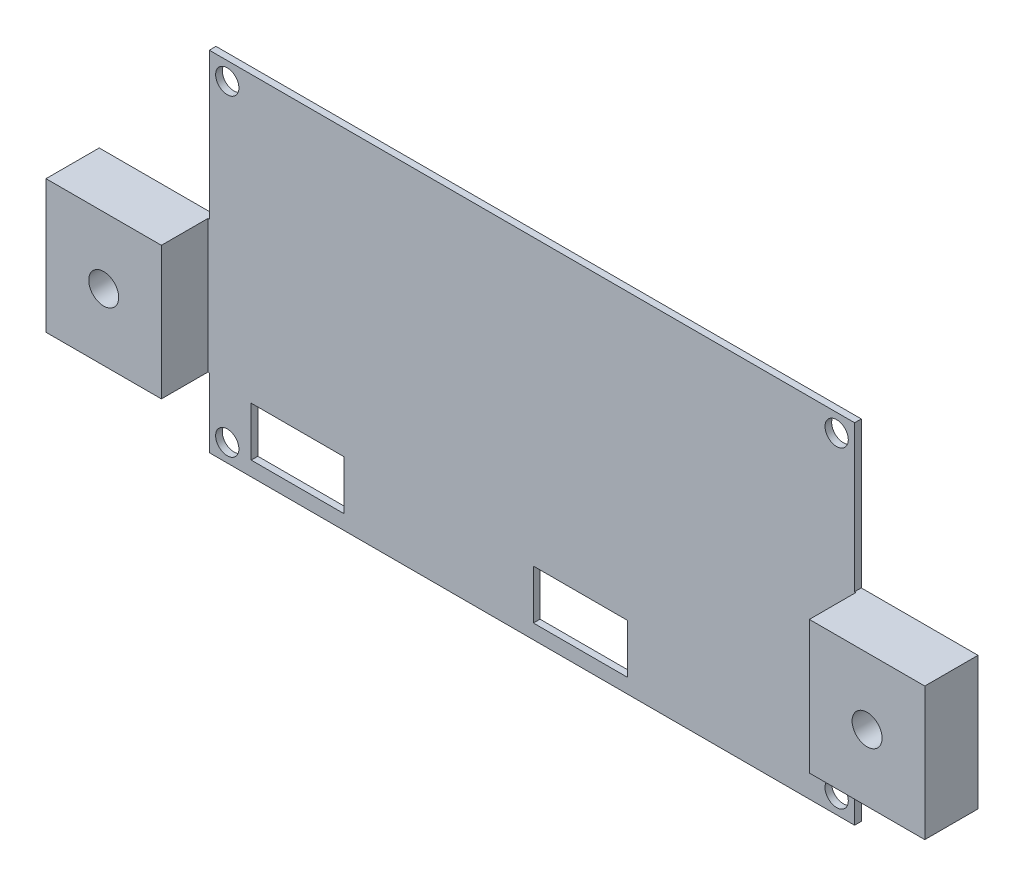
ISO-10303-21;
HEADER;
FILE_DESCRIPTION(('STEP AP214'),'2;1');
FILE_NAME('part.step','',(''),(''),'','','');
FILE_SCHEMA(('AUTOMOTIVE_DESIGN { 1 0 10303 214 1 1 1 1 }'));
ENDSEC;
DATA;
#1=APPLICATION_CONTEXT('core data for automotive mechanical design processes');
#2=APPLICATION_PROTOCOL_DEFINITION('international standard','automotive_design',2000,#1);
#3=PRODUCT_CONTEXT('',#1,'mechanical');
#4=PRODUCT('Part','Part','',(#3));
#5=PRODUCT_RELATED_PRODUCT_CATEGORY('part','',(#4));
#6=PRODUCT_DEFINITION_FORMATION('','',#4);
#7=PRODUCT_DEFINITION_CONTEXT('part definition',#1,'design');
#8=PRODUCT_DEFINITION('design','',#6,#7);
#9=PRODUCT_DEFINITION_SHAPE('','',#8);
#10=(LENGTH_UNIT() NAMED_UNIT(*) SI_UNIT(.MILLI.,.METRE.));
#11=(NAMED_UNIT(*) PLANE_ANGLE_UNIT() SI_UNIT($,.RADIAN.));
#12=(NAMED_UNIT(*) SI_UNIT($,.STERADIAN.) SOLID_ANGLE_UNIT());
#13=UNCERTAINTY_MEASURE_WITH_UNIT(LENGTH_MEASURE(1.E-05),#10,'distance_accuracy_value','');
#14=(GEOMETRIC_REPRESENTATION_CONTEXT(3) GLOBAL_UNCERTAINTY_ASSIGNED_CONTEXT((#13)) GLOBAL_UNIT_ASSIGNED_CONTEXT((#10,
#11,#12)) REPRESENTATION_CONTEXT('',''));
#15=CARTESIAN_POINT('',(0.,0.,0.));
#16=DIRECTION('',(0.,0.,1.));
#17=DIRECTION('',(1.,0.,0.));
#18=AXIS2_PLACEMENT_3D('',#15,#16,#17);
#19=CARTESIAN_POINT('',(0.,0.,1.));
#20=DIRECTION('',(0.,0.,-1.));
#21=DIRECTION('',(-1.,0.,0.));
#22=AXIS2_PLACEMENT_3D('',#19,#20,#21);
#23=PLANE('',#22);
#24=DIRECTION('',(0.,1.,0.));
#25=VECTOR('',#24,1.);
#26=CARTESIAN_POINT('',(62.8755550121784,2.18592698705528,1.));
#27=LINE('',#26,#25);
#28=CARTESIAN_POINT('',(62.8755550121784,2.18592698705528,1.));
#29=VERTEX_POINT('',#28);
#30=CARTESIAN_POINT('',(62.8755550121784,9.59959441499132,1.));
#31=VERTEX_POINT('',#30);
#32=EDGE_CURVE('E248',#29,#31,#27,.T.);
#33=ORIENTED_EDGE('',*,*,#32,.F.);
#34=DIRECTION('',(1.,0.,0.));
#35=VECTOR('',#34,1.);
#36=CARTESIAN_POINT('',(62.8755550121784,2.18592698705528,1.));
#37=LINE('',#36,#35);
#38=CARTESIAN_POINT('',(48.716607668951,2.18592698705528,1.));
#39=VERTEX_POINT('',#38);
#40=EDGE_CURVE('E256',#39,#29,#37,.T.);
#41=ORIENTED_EDGE('',*,*,#40,.F.);
#42=DIRECTION('',(0.,-1.,0.));
#43=VECTOR('',#42,1.);
#44=CARTESIAN_POINT('',(48.716607668951,2.18592698705528,1.));
#45=LINE('',#44,#43);
#46=CARTESIAN_POINT('',(48.716607668951,9.59959441499132,1.));
#47=VERTEX_POINT('',#46);
#48=EDGE_CURVE('E253',#47,#39,#45,.T.);
#49=ORIENTED_EDGE('',*,*,#48,.F.);
#50=DIRECTION('',(-1.,0.,0.));
#51=VECTOR('',#50,1.);
#52=CARTESIAN_POINT('',(62.8755550121784,9.59959441499132,1.));
#53=LINE('',#52,#51);
#54=EDGE_CURVE('E250',#31,#47,#53,.T.);
#55=ORIENTED_EDGE('',*,*,#54,.F.);
#56=EDGE_LOOP('',(#33,#41,#49,#55));
#57=FACE_BOUND('',#56,.T.);
#58=CARTESIAN_POINT('',(2.69999999999999,49.7,1.));
#59=DIRECTION('',(0.,0.,1.));
#60=DIRECTION('',(1.,0.,0.));
#61=AXIS2_PLACEMENT_3D('',#58,#59,#60);
#62=CIRCLE('',#61,1.75);
#63=CARTESIAN_POINT('',(4.45,49.7,1.));
#64=VERTEX_POINT('',#63);
#65=EDGE_CURVE('E310',#64,#64,#62,.T.);
#66=ORIENTED_EDGE('',*,*,#65,.F.);
#67=EDGE_LOOP('',(#66));
#68=FACE_BOUND('',#67,.T.);
#69=CARTESIAN_POINT('',(2.7,2.7,1.));
#70=DIRECTION('',(0.,0.,1.));
#71=DIRECTION('',(1.,0.,0.));
#72=AXIS2_PLACEMENT_3D('',#69,#70,#71);
#73=CIRCLE('',#72,1.75);
#74=CARTESIAN_POINT('',(4.45,2.7,1.));
#75=VERTEX_POINT('',#74);
#76=EDGE_CURVE('E316',#75,#75,#73,.T.);
#77=ORIENTED_EDGE('',*,*,#76,.F.);
#78=EDGE_LOOP('',(#77));
#79=FACE_BOUND('',#78,.T.);
#80=CARTESIAN_POINT('',(94.3,2.70000000000001,1.));
#81=DIRECTION('',(0.,0.,1.));
#82=DIRECTION('',(1.,0.,0.));
#83=AXIS2_PLACEMENT_3D('',#80,#81,#82);
#84=CIRCLE('',#83,1.75);
#85=CARTESIAN_POINT('',(96.05,2.70000000000001,1.));
#86=VERTEX_POINT('',#85);
#87=EDGE_CURVE('E322',#86,#86,#84,.T.);
#88=ORIENTED_EDGE('',*,*,#87,.F.);
#89=EDGE_LOOP('',(#88));
#90=FACE_BOUND('',#89,.T.);
#91=CARTESIAN_POINT('',(94.3,49.7,1.));
#92=DIRECTION('',(0.,0.,1.));
#93=DIRECTION('',(1.,0.,0.));
#94=AXIS2_PLACEMENT_3D('',#91,#92,#93);
#95=CIRCLE('',#94,1.75);
#96=CARTESIAN_POINT('',(96.05,49.7,1.));
#97=VERTEX_POINT('',#96);
#98=EDGE_CURVE('E328',#97,#97,#95,.T.);
#99=ORIENTED_EDGE('',*,*,#98,.F.);
#100=EDGE_LOOP('',(#99));
#101=FACE_BOUND('',#100,.T.);
#102=DIRECTION('',(0.,-1.,0.));
#103=VECTOR('',#102,1.);
#104=CARTESIAN_POINT('',(6.29845885437089,2.18592698705528,1.));
#105=LINE('',#104,#103);
#106=CARTESIAN_POINT('',(6.29845885437089,9.59959441499131,1.));
#107=VERTEX_POINT('',#106);
#108=CARTESIAN_POINT('',(6.29845885437089,2.18592698705528,1.));
#109=VERTEX_POINT('',#108);
#110=EDGE_CURVE('E279',#107,#109,#105,.T.);
#111=ORIENTED_EDGE('',*,*,#110,.F.);
#112=DIRECTION('',(-1.,0.,0.));
#113=VECTOR('',#112,1.);
#114=CARTESIAN_POINT('',(6.29845885437089,9.59959441499131,1.));
#115=LINE('',#114,#113);
#116=CARTESIAN_POINT('',(20.2146229173687,9.59959441499131,1.));
#117=VERTEX_POINT('',#116);
#118=EDGE_CURVE('E287',#117,#107,#115,.T.);
#119=ORIENTED_EDGE('',*,*,#118,.F.);
#120=DIRECTION('',(0.,1.,0.));
#121=VECTOR('',#120,1.);
#122=CARTESIAN_POINT('',(20.2146229173687,2.18592698705528,1.));
#123=LINE('',#122,#121);
#124=CARTESIAN_POINT('',(20.2146229173687,2.18592698705528,1.));
#125=VERTEX_POINT('',#124);
#126=EDGE_CURVE('E284',#125,#117,#123,.T.);
#127=ORIENTED_EDGE('',*,*,#126,.F.);
#128=DIRECTION('',(1.,0.,0.));
#129=VECTOR('',#128,1.);
#130=CARTESIAN_POINT('',(6.29845885437089,2.18592698705528,1.));
#131=LINE('',#130,#129);
#132=EDGE_CURVE('E281',#109,#125,#131,.T.);
#133=ORIENTED_EDGE('',*,*,#132,.F.);
#134=EDGE_LOOP('',(#111,#119,#127,#133));
#135=FACE_BOUND('',#134,.T.);
#136=DIRECTION('',(1.,0.,0.));
#137=VECTOR('',#136,1.);
#138=CARTESIAN_POINT('',(114.547708730617,10.4,1.));
#139=LINE('',#138,#137);
#140=CARTESIAN_POINT('',(97.,10.4,1.));
#141=VERTEX_POINT('',#140);
#142=CARTESIAN_POINT('',(97.2,10.4,1.));
#143=VERTEX_POINT('',#142);
#144=EDGE_CURVE('E49',#141,#143,#139,.T.);
#145=ORIENTED_EDGE('',*,*,#144,.T.);
#146=DIRECTION('',(0.,1.,0.));
#147=VECTOR('',#146,1.);
#148=CARTESIAN_POINT('',(97.2,0.,1.));
#149=LINE('',#148,#147);
#150=CARTESIAN_POINT('',(97.2,30.4,1.));
#151=VERTEX_POINT('',#150);
#152=EDGE_CURVE('E201',#143,#151,#149,.T.);
#153=ORIENTED_EDGE('',*,*,#152,.T.);
#154=DIRECTION('',(-1.,0.,0.));
#155=VECTOR('',#154,1.);
#156=CARTESIAN_POINT('',(97.,30.4,1.));
#157=LINE('',#156,#155);
#158=CARTESIAN_POINT('',(97.,30.4,1.));
#159=VERTEX_POINT('',#158);
#160=EDGE_CURVE('E343',#151,#159,#157,.T.);
#161=ORIENTED_EDGE('',*,*,#160,.T.);
#162=DIRECTION('',(0.,1.,0.));
#163=VECTOR('',#162,1.);
#164=CARTESIAN_POINT('',(97.,30.4,1.));
#165=LINE('',#164,#163);
#166=CARTESIAN_POINT('',(97.,52.4,1.));
#167=VERTEX_POINT('',#166);
#168=EDGE_CURVE('E345',#159,#167,#165,.T.);
#169=ORIENTED_EDGE('',*,*,#168,.T.);
#170=DIRECTION('',(-1.,0.,0.));
#171=VECTOR('',#170,1.);
#172=CARTESIAN_POINT('',(0.,52.4,1.));
#173=LINE('',#172,#171);
#174=CARTESIAN_POINT('',(0.,52.4,1.));
#175=VERTEX_POINT('',#174);
#176=EDGE_CURVE('E347',#167,#175,#173,.T.);
#177=ORIENTED_EDGE('',*,*,#176,.T.);
#178=DIRECTION('',(0.,-1.,0.));
#179=VECTOR('',#178,1.);
#180=CARTESIAN_POINT('',(0.,30.4,1.));
#181=LINE('',#180,#179);
#182=CARTESIAN_POINT('',(0.,30.4,1.));
#183=VERTEX_POINT('',#182);
#184=EDGE_CURVE('E349',#175,#183,#181,.T.);
#185=ORIENTED_EDGE('',*,*,#184,.T.);
#186=DIRECTION('',(-1.,0.,0.));
#187=VECTOR('',#186,1.);
#188=CARTESIAN_POINT('',(0.,30.4,1.));
#189=LINE('',#188,#187);
#190=CARTESIAN_POINT('',(-0.200000000000008,30.4,1.));
#191=VERTEX_POINT('',#190);
#192=EDGE_CURVE('E351',#183,#191,#189,.T.);
#193=ORIENTED_EDGE('',*,*,#192,.T.);
#194=DIRECTION('',(0.,1.,0.));
#195=VECTOR('',#194,1.);
#196=CARTESIAN_POINT('',(-0.200000000000008,0.,1.));
#197=LINE('',#196,#195);
#198=CARTESIAN_POINT('',(-0.200000000000009,10.4,1.));
#199=VERTEX_POINT('',#198);
#200=EDGE_CURVE('E56',#199,#191,#197,.T.);
#201=ORIENTED_EDGE('',*,*,#200,.F.);
#202=DIRECTION('',(1.,0.,0.));
#203=VECTOR('',#202,1.);
#204=CARTESIAN_POINT('',(-17.5477087306169,10.4,1.));
#205=LINE('',#204,#203);
#206=CARTESIAN_POINT('',(0.,10.4,1.));
#207=VERTEX_POINT('',#206);
#208=EDGE_CURVE('E353',#199,#207,#205,.T.);
#209=ORIENTED_EDGE('',*,*,#208,.T.);
#210=DIRECTION('',(0.,-1.,0.));
#211=VECTOR('',#210,1.);
#212=CARTESIAN_POINT('',(0.,0.,1.));
#213=LINE('',#212,#211);
#214=CARTESIAN_POINT('',(0.,0.,1.));
#215=VERTEX_POINT('',#214);
#216=EDGE_CURVE('E334',#207,#215,#213,.T.);
#217=ORIENTED_EDGE('',*,*,#216,.T.);
#218=DIRECTION('',(1.,0.,0.));
#219=VECTOR('',#218,1.);
#220=CARTESIAN_POINT('',(0.,0.,1.));
#221=LINE('',#220,#219);
#222=CARTESIAN_POINT('',(97.,0.,1.));
#223=VERTEX_POINT('',#222);
#224=EDGE_CURVE('E337',#215,#223,#221,.T.);
#225=ORIENTED_EDGE('',*,*,#224,.T.);
#226=DIRECTION('',(0.,1.,0.));
#227=VECTOR('',#226,1.);
#228=CARTESIAN_POINT('',(97.,0.,1.));
#229=LINE('',#228,#227);
#230=EDGE_CURVE('E340',#223,#141,#229,.T.);
#231=ORIENTED_EDGE('',*,*,#230,.T.);
#232=EDGE_LOOP('',(#145,#153,#161,#169,#177,#185,#193,#201,#209,#217,#225,#231));
#233=FACE_BOUND('',#232,.T.);
#234=ADVANCED_FACE('F34',(#57,#68,#79,#90,#101,#135,#233),#23,.F.);
#235=CARTESIAN_POINT('',(0.,0.,0.));
#236=DIRECTION('',(0.,0.,-1.));
#237=DIRECTION('',(-1.,0.,0.));
#238=AXIS2_PLACEMENT_3D('',#235,#236,#237);
#239=PLANE('',#238);
#240=CARTESIAN_POINT('',(-8.87385436530845,20.4,0.));
#241=DIRECTION('',(0.,0.,1.));
#242=DIRECTION('',(1.,0.,0.));
#243=AXIS2_PLACEMENT_3D('',#240,#241,#242);
#244=CIRCLE('',#243,2.25);
#245=CARTESIAN_POINT('',(-6.62385436530845,20.4,0.));
#246=VERTEX_POINT('',#245);
#247=EDGE_CURVE('E220',#246,#246,#244,.T.);
#248=ORIENTED_EDGE('',*,*,#247,.T.);
#249=EDGE_LOOP('',(#248));
#250=FACE_BOUND('',#249,.T.);
#251=CARTESIAN_POINT('',(105.873854365308,20.4,0.));
#252=DIRECTION('',(0.,0.,1.));
#253=DIRECTION('',(-1.,0.,0.));
#254=AXIS2_PLACEMENT_3D('',#251,#252,#253);
#255=CIRCLE('',#254,2.25);
#256=CARTESIAN_POINT('',(103.623854365308,20.4,0.));
#257=VERTEX_POINT('',#256);
#258=EDGE_CURVE('E698',#257,#257,#255,.T.);
#259=ORIENTED_EDGE('',*,*,#258,.T.);
#260=EDGE_LOOP('',(#259));
#261=FACE_BOUND('',#260,.T.);
#262=CARTESIAN_POINT('',(2.7,2.7,0.));
#263=DIRECTION('',(0.,0.,1.));
#264=DIRECTION('',(1.,0.,0.));
#265=AXIS2_PLACEMENT_3D('',#262,#263,#264);
#266=CIRCLE('',#265,1.75);
#267=CARTESIAN_POINT('',(4.45,2.7,0.));
#268=VERTEX_POINT('',#267);
#269=EDGE_CURVE('E313',#268,#268,#266,.T.);
#270=ORIENTED_EDGE('',*,*,#269,.T.);
#271=EDGE_LOOP('',(#270));
#272=FACE_BOUND('',#271,.T.);
#273=CARTESIAN_POINT('',(94.3,49.7,0.));
#274=DIRECTION('',(0.,0.,1.));
#275=DIRECTION('',(1.,0.,0.));
#276=AXIS2_PLACEMENT_3D('',#273,#274,#275);
#277=CIRCLE('',#276,1.75);
#278=CARTESIAN_POINT('',(96.05,49.7,0.));
#279=VERTEX_POINT('',#278);
#280=EDGE_CURVE('E325',#279,#279,#277,.T.);
#281=ORIENTED_EDGE('',*,*,#280,.T.);
#282=EDGE_LOOP('',(#281));
#283=FACE_BOUND('',#282,.T.);
#284=DIRECTION('',(0.,-1.,0.));
#285=VECTOR('',#284,1.);
#286=CARTESIAN_POINT('',(0.,0.,0.));
#287=LINE('',#286,#285);
#288=CARTESIAN_POINT('',(0.,10.4,0.));
#289=VERTEX_POINT('',#288);
#290=CARTESIAN_POINT('',(0.,0.,0.));
#291=VERTEX_POINT('',#290);
#292=EDGE_CURVE('E331',#289,#291,#287,.T.);
#293=ORIENTED_EDGE('',*,*,#292,.F.);
#294=DIRECTION('',(1.,0.,0.));
#295=VECTOR('',#294,1.);
#296=CARTESIAN_POINT('',(-17.5477087306169,10.4,0.));
#297=LINE('',#296,#295);
#298=CARTESIAN_POINT('',(-17.5477087306169,10.4,0.));
#299=VERTEX_POINT('',#298);
#300=EDGE_CURVE('E338',#299,#289,#297,.T.);
#301=ORIENTED_EDGE('',*,*,#300,.F.);
#302=DIRECTION('',(0.,-1.,0.));
#303=VECTOR('',#302,1.);
#304=CARTESIAN_POINT('',(-17.5477087306169,30.4,0.));
#305=LINE('',#304,#303);
#306=CARTESIAN_POINT('',(-17.5477087306169,30.4,0.));
#307=VERTEX_POINT('',#306);
#308=EDGE_CURVE('E376',#307,#299,#305,.T.);
#309=ORIENTED_EDGE('',*,*,#308,.F.);
#310=DIRECTION('',(-1.,0.,0.));
#311=VECTOR('',#310,1.);
#312=CARTESIAN_POINT('',(0.,30.4,0.));
#313=LINE('',#312,#311);
#314=CARTESIAN_POINT('',(0.,30.4,0.));
#315=VERTEX_POINT('',#314);
#316=EDGE_CURVE('E374',#315,#307,#313,.T.);
#317=ORIENTED_EDGE('',*,*,#316,.F.);
#318=DIRECTION('',(0.,-1.,0.));
#319=VECTOR('',#318,1.);
#320=CARTESIAN_POINT('',(0.,30.4,0.));
#321=LINE('',#320,#319);
#322=CARTESIAN_POINT('',(0.,52.4,0.));
#323=VERTEX_POINT('',#322);
#324=EDGE_CURVE('E372',#323,#315,#321,.T.);
#325=ORIENTED_EDGE('',*,*,#324,.F.);
#326=DIRECTION('',(-1.,0.,0.));
#327=VECTOR('',#326,1.);
#328=CARTESIAN_POINT('',(0.,52.4,0.));
#329=LINE('',#328,#327);
#330=CARTESIAN_POINT('',(97.,52.4,0.));
#331=VERTEX_POINT('',#330);
#332=EDGE_CURVE('E370',#331,#323,#329,.T.);
#333=ORIENTED_EDGE('',*,*,#332,.F.);
#334=DIRECTION('',(0.,1.,0.));
#335=VECTOR('',#334,1.);
#336=CARTESIAN_POINT('',(97.,30.4,0.));
#337=LINE('',#336,#335);
#338=CARTESIAN_POINT('',(97.,30.4,0.));
#339=VERTEX_POINT('',#338);
#340=EDGE_CURVE('E368',#339,#331,#337,.T.);
#341=ORIENTED_EDGE('',*,*,#340,.F.);
#342=DIRECTION('',(-1.,0.,0.));
#343=VECTOR('',#342,1.);
#344=CARTESIAN_POINT('',(97.,30.4,0.));
#345=LINE('',#344,#343);
#346=CARTESIAN_POINT('',(114.547708730617,30.4,0.));
#347=VERTEX_POINT('',#346);
#348=EDGE_CURVE('E366',#347,#339,#345,.T.);
#349=ORIENTED_EDGE('',*,*,#348,.F.);
#350=DIRECTION('',(0.,1.,0.));
#351=VECTOR('',#350,1.);
#352=CARTESIAN_POINT('',(114.547708730617,30.4,0.));
#353=LINE('',#352,#351);
#354=CARTESIAN_POINT('',(114.547708730617,10.4,0.));
#355=VERTEX_POINT('',#354);
#356=EDGE_CURVE('E364',#355,#347,#353,.T.);
#357=ORIENTED_EDGE('',*,*,#356,.F.);
#358=DIRECTION('',(1.,0.,0.));
#359=VECTOR('',#358,1.);
#360=CARTESIAN_POINT('',(114.547708730617,10.4,0.));
#361=LINE('',#360,#359);
#362=CARTESIAN_POINT('',(97.,10.4,0.));
#363=VERTEX_POINT('',#362);
#364=EDGE_CURVE('E362',#363,#355,#361,.T.);
#365=ORIENTED_EDGE('',*,*,#364,.F.);
#366=DIRECTION('',(0.,1.,0.));
#367=VECTOR('',#366,1.);
#368=CARTESIAN_POINT('',(97.,0.,0.));
#369=LINE('',#368,#367);
#370=CARTESIAN_POINT('',(97.,0.,0.));
#371=VERTEX_POINT('',#370);
#372=EDGE_CURVE('E360',#371,#363,#369,.T.);
#373=ORIENTED_EDGE('',*,*,#372,.F.);
#374=DIRECTION('',(1.,0.,0.));
#375=VECTOR('',#374,1.);
#376=CARTESIAN_POINT('',(0.,0.,0.));
#377=LINE('',#376,#375);
#378=EDGE_CURVE('E358',#291,#371,#377,.T.);
#379=ORIENTED_EDGE('',*,*,#378,.F.);
#380=EDGE_LOOP('',(#293,#301,#309,#317,#325,#333,#341,#349,#357,#365,#373,#379));
#381=FACE_BOUND('',#380,.T.);
#382=CARTESIAN_POINT('',(94.3,2.70000000000001,0.));
#383=DIRECTION('',(0.,0.,1.));
#384=DIRECTION('',(1.,0.,0.));
#385=AXIS2_PLACEMENT_3D('',#382,#383,#384);
#386=CIRCLE('',#385,1.75);
#387=CARTESIAN_POINT('',(96.05,2.70000000000001,0.));
#388=VERTEX_POINT('',#387);
#389=EDGE_CURVE('E319',#388,#388,#386,.T.);
#390=ORIENTED_EDGE('',*,*,#389,.T.);
#391=EDGE_LOOP('',(#390));
#392=FACE_BOUND('',#391,.T.);
#393=CARTESIAN_POINT('',(2.69999999999999,49.7,0.));
#394=DIRECTION('',(0.,0.,1.));
#395=DIRECTION('',(1.,0.,0.));
#396=AXIS2_PLACEMENT_3D('',#393,#394,#395);
#397=CIRCLE('',#396,1.75);
#398=CARTESIAN_POINT('',(4.45,49.7,0.));
#399=VERTEX_POINT('',#398);
#400=EDGE_CURVE('E309',#399,#399,#397,.T.);
#401=ORIENTED_EDGE('',*,*,#400,.T.);
#402=EDGE_LOOP('',(#401));
#403=FACE_BOUND('',#402,.T.);
#404=DIRECTION('',(-1.,0.,0.));
#405=VECTOR('',#404,1.);
#406=CARTESIAN_POINT('',(6.29845885437089,9.59959441499131,0.));
#407=LINE('',#406,#405);
#408=CARTESIAN_POINT('',(20.2146229173687,9.59959441499131,0.));
#409=VERTEX_POINT('',#408);
#410=CARTESIAN_POINT('',(6.29845885437089,9.59959441499131,0.));
#411=VERTEX_POINT('',#410);
#412=EDGE_CURVE('E282',#409,#411,#407,.T.);
#413=ORIENTED_EDGE('',*,*,#412,.T.);
#414=DIRECTION('',(0.,-1.,0.));
#415=VECTOR('',#414,1.);
#416=CARTESIAN_POINT('',(6.29845885437089,2.18592698705528,0.));
#417=LINE('',#416,#415);
#418=CARTESIAN_POINT('',(6.29845885437089,2.18592698705528,0.));
#419=VERTEX_POINT('',#418);
#420=EDGE_CURVE('E278',#411,#419,#417,.T.);
#421=ORIENTED_EDGE('',*,*,#420,.T.);
#422=DIRECTION('',(1.,0.,0.));
#423=VECTOR('',#422,1.);
#424=CARTESIAN_POINT('',(6.29845885437089,2.18592698705528,0.));
#425=LINE('',#424,#423);
#426=CARTESIAN_POINT('',(20.2146229173687,2.18592698705528,0.));
#427=VERTEX_POINT('',#426);
#428=EDGE_CURVE('E292',#419,#427,#425,.T.);
#429=ORIENTED_EDGE('',*,*,#428,.T.);
#430=DIRECTION('',(0.,1.,0.));
#431=VECTOR('',#430,1.);
#432=CARTESIAN_POINT('',(20.2146229173687,2.18592698705528,0.));
#433=LINE('',#432,#431);
#434=EDGE_CURVE('E295',#427,#409,#433,.T.);
#435=ORIENTED_EDGE('',*,*,#434,.T.);
#436=EDGE_LOOP('',(#413,#421,#429,#435));
#437=FACE_BOUND('',#436,.T.);
#438=DIRECTION('',(1.,0.,0.));
#439=VECTOR('',#438,1.);
#440=CARTESIAN_POINT('',(62.8755550121784,2.18592698705528,0.));
#441=LINE('',#440,#439);
#442=CARTESIAN_POINT('',(48.716607668951,2.18592698705528,0.));
#443=VERTEX_POINT('',#442);
#444=CARTESIAN_POINT('',(62.8755550121784,2.18592698705528,0.));
#445=VERTEX_POINT('',#444);
#446=EDGE_CURVE('E251',#443,#445,#441,.T.);
#447=ORIENTED_EDGE('',*,*,#446,.T.);
#448=DIRECTION('',(0.,1.,0.));
#449=VECTOR('',#448,1.);
#450=CARTESIAN_POINT('',(62.8755550121784,2.18592698705528,0.));
#451=LINE('',#450,#449);
#452=CARTESIAN_POINT('',(62.8755550121784,9.59959441499132,0.));
#453=VERTEX_POINT('',#452);
#454=EDGE_CURVE('E247',#445,#453,#451,.T.);
#455=ORIENTED_EDGE('',*,*,#454,.T.);
#456=DIRECTION('',(-1.,0.,0.));
#457=VECTOR('',#456,1.);
#458=CARTESIAN_POINT('',(62.8755550121784,9.59959441499132,0.));
#459=LINE('',#458,#457);
#460=CARTESIAN_POINT('',(48.716607668951,9.59959441499132,0.));
#461=VERTEX_POINT('',#460);
#462=EDGE_CURVE('E261',#453,#461,#459,.T.);
#463=ORIENTED_EDGE('',*,*,#462,.T.);
#464=DIRECTION('',(0.,-1.,0.));
#465=VECTOR('',#464,1.);
#466=CARTESIAN_POINT('',(48.716607668951,2.18592698705528,0.));
#467=LINE('',#466,#465);
#468=EDGE_CURVE('E264',#461,#443,#467,.T.);
#469=ORIENTED_EDGE('',*,*,#468,.T.);
#470=EDGE_LOOP('',(#447,#455,#463,#469));
#471=FACE_BOUND('',#470,.T.);
#472=ADVANCED_FACE('F416',(#250,#261,#272,#283,#381,#392,#403,#437,#471),#239,.T.);
#473=CARTESIAN_POINT('',(0.,0.,1.));
#474=DIRECTION('',(1.,0.,0.));
#475=DIRECTION('',(0.,0.,-1.));
#476=AXIS2_PLACEMENT_3D('',#473,#474,#475);
#477=PLANE('',#476);
#478=ORIENTED_EDGE('',*,*,#292,.T.);
#479=DIRECTION('',(0.,0.,-1.));
#480=VECTOR('',#479,1.);
#481=CARTESIAN_POINT('',(0.,0.,1.));
#482=LINE('',#481,#480);
#483=EDGE_CURVE('E11',#215,#291,#482,.T.);
#484=ORIENTED_EDGE('',*,*,#483,.F.);
#485=ORIENTED_EDGE('',*,*,#216,.F.);
#486=DIRECTION('',(0.,0.,-1.));
#487=VECTOR('',#486,1.);
#488=CARTESIAN_POINT('',(0.,10.4,1.));
#489=LINE('',#488,#487);
#490=EDGE_CURVE('E355',#207,#289,#489,.T.);
#491=ORIENTED_EDGE('',*,*,#490,.T.);
#492=EDGE_LOOP('',(#478,#484,#485,#491));
#493=FACE_BOUND('',#492,.T.);
#494=ADVANCED_FACE('F36',(#493),#477,.F.);
#495=CARTESIAN_POINT('',(0.,0.,1.));
#496=DIRECTION('',(0.,1.,0.));
#497=DIRECTION('',(0.,0.,1.));
#498=AXIS2_PLACEMENT_3D('',#495,#496,#497);
#499=PLANE('',#498);
#500=ORIENTED_EDGE('',*,*,#378,.T.);
#501=DIRECTION('',(0.,0.,-1.));
#502=VECTOR('',#501,1.);
#503=CARTESIAN_POINT('',(97.,0.,1.));
#504=LINE('',#503,#502);
#505=EDGE_CURVE('E42',#223,#371,#504,.T.);
#506=ORIENTED_EDGE('',*,*,#505,.F.);
#507=ORIENTED_EDGE('',*,*,#224,.F.);
#508=ORIENTED_EDGE('',*,*,#483,.T.);
#509=EDGE_LOOP('',(#500,#506,#507,#508));
#510=FACE_BOUND('',#509,.T.);
#511=ADVANCED_FACE('F471',(#510),#499,.F.);
#512=CARTESIAN_POINT('',(97.,0.,1.));
#513=DIRECTION('',(-1.,0.,0.));
#514=DIRECTION('',(0.,-1.,0.));
#515=AXIS2_PLACEMENT_3D('',#512,#513,#514);
#516=PLANE('',#515);
#517=ORIENTED_EDGE('',*,*,#372,.T.);
#518=DIRECTION('',(0.,0.,-1.));
#519=VECTOR('',#518,1.);
#520=CARTESIAN_POINT('',(97.,10.4,1.));
#521=LINE('',#520,#519);
#522=EDGE_CURVE('E403',#141,#363,#521,.T.);
#523=ORIENTED_EDGE('',*,*,#522,.F.);
#524=ORIENTED_EDGE('',*,*,#230,.F.);
#525=ORIENTED_EDGE('',*,*,#505,.T.);
#526=EDGE_LOOP('',(#517,#523,#524,#525));
#527=FACE_BOUND('',#526,.T.);
#528=ADVANCED_FACE('F410',(#527),#516,.F.);
#529=CARTESIAN_POINT('',(114.547708730617,10.4,1.));
#530=DIRECTION('',(0.,1.,0.));
#531=DIRECTION('',(-1.,0.,0.));
#532=AXIS2_PLACEMENT_3D('',#529,#530,#531);
#533=PLANE('',#532);
#534=ORIENTED_EDGE('',*,*,#364,.T.);
#535=DIRECTION('',(0.,0.,-1.));
#536=VECTOR('',#535,1.);
#537=CARTESIAN_POINT('',(114.547708730617,10.4,1.));
#538=LINE('',#537,#536);
#539=CARTESIAN_POINT('',(114.547708730617,10.4,8.));
#540=VERTEX_POINT('',#539);
#541=EDGE_CURVE('E209',#540,#355,#538,.T.);
#542=ORIENTED_EDGE('',*,*,#541,.F.);
#543=DIRECTION('',(1.,0.,0.));
#544=VECTOR('',#543,1.);
#545=CARTESIAN_POINT('',(0.,10.4,8.));
#546=LINE('',#545,#544);
#547=CARTESIAN_POINT('',(97.2,10.4,8.));
#548=VERTEX_POINT('',#547);
#549=EDGE_CURVE('E206',#548,#540,#546,.T.);
#550=ORIENTED_EDGE('',*,*,#549,.F.);
#551=DIRECTION('',(0.,0.,-1.));
#552=VECTOR('',#551,1.);
#553=CARTESIAN_POINT('',(97.2,10.4,8.));
#554=LINE('',#553,#552);
#555=EDGE_CURVE('E195',#548,#143,#554,.T.);
#556=ORIENTED_EDGE('',*,*,#555,.T.);
#557=ORIENTED_EDGE('',*,*,#144,.F.);
#558=ORIENTED_EDGE('',*,*,#522,.T.);
#559=EDGE_LOOP('',(#534,#542,#550,#556,#557,#558));
#560=FACE_BOUND('',#559,.T.);
#561=ADVANCED_FACE('F207',(#560),#533,.F.);
#562=CARTESIAN_POINT('',(114.547708730617,30.4,1.));
#563=DIRECTION('',(-1.,0.,0.));
#564=DIRECTION('',(0.,0.,1.));
#565=AXIS2_PLACEMENT_3D('',#562,#563,#564);
#566=PLANE('',#565);
#567=ORIENTED_EDGE('',*,*,#356,.T.);
#568=DIRECTION('',(0.,0.,-1.));
#569=VECTOR('',#568,1.);
#570=CARTESIAN_POINT('',(114.547708730617,30.4,1.));
#571=LINE('',#570,#569);
#572=CARTESIAN_POINT('',(114.547708730617,30.4,8.));
#573=VERTEX_POINT('',#572);
#574=EDGE_CURVE('E399',#573,#347,#571,.T.);
#575=ORIENTED_EDGE('',*,*,#574,.F.);
#576=DIRECTION('',(0.,1.,0.));
#577=VECTOR('',#576,1.);
#578=CARTESIAN_POINT('',(114.547708730617,0.,8.));
#579=LINE('',#578,#577);
#580=EDGE_CURVE('E213',#540,#573,#579,.T.);
#581=ORIENTED_EDGE('',*,*,#580,.F.);
#582=ORIENTED_EDGE('',*,*,#541,.T.);
#583=EDGE_LOOP('',(#567,#575,#581,#582));
#584=FACE_BOUND('',#583,.T.);
#585=ADVANCED_FACE('F421',(#584),#566,.F.);
#586=CARTESIAN_POINT('',(97.,30.4,1.));
#587=DIRECTION('',(0.,-1.,0.));
#588=DIRECTION('',(1.,0.,0.));
#589=AXIS2_PLACEMENT_3D('',#586,#587,#588);
#590=PLANE('',#589);
#591=ORIENTED_EDGE('',*,*,#348,.T.);
#592=DIRECTION('',(0.,0.,-1.));
#593=VECTOR('',#592,1.);
#594=CARTESIAN_POINT('',(97.,30.4,1.));
#595=LINE('',#594,#593);
#596=EDGE_CURVE('E396',#159,#339,#595,.T.);
#597=ORIENTED_EDGE('',*,*,#596,.F.);
#598=ORIENTED_EDGE('',*,*,#160,.F.);
#599=DIRECTION('',(0.,0.,-1.));
#600=VECTOR('',#599,1.);
#601=CARTESIAN_POINT('',(97.2,30.4,8.));
#602=LINE('',#601,#600);
#603=CARTESIAN_POINT('',(97.2,30.4,8.));
#604=VERTEX_POINT('',#603);
#605=EDGE_CURVE('E203',#604,#151,#602,.T.);
#606=ORIENTED_EDGE('',*,*,#605,.F.);
#607=DIRECTION('',(-1.,0.,0.));
#608=VECTOR('',#607,1.);
#609=CARTESIAN_POINT('',(0.,30.3999999999999,8.));
#610=LINE('',#609,#608);
#611=EDGE_CURVE('E217',#573,#604,#610,.T.);
#612=ORIENTED_EDGE('',*,*,#611,.F.);
#613=ORIENTED_EDGE('',*,*,#574,.T.);
#614=EDGE_LOOP('',(#591,#597,#598,#606,#612,#613));
#615=FACE_BOUND('',#614,.T.);
#616=ADVANCED_FACE('F423',(#615),#590,.F.);
#617=CARTESIAN_POINT('',(97.,30.4,1.));
#618=DIRECTION('',(-1.,0.,0.));
#619=DIRECTION('',(0.,0.,1.));
#620=AXIS2_PLACEMENT_3D('',#617,#618,#619);
#621=PLANE('',#620);
#622=ORIENTED_EDGE('',*,*,#340,.T.);
#623=DIRECTION('',(0.,0.,-1.));
#624=VECTOR('',#623,1.);
#625=CARTESIAN_POINT('',(97.,52.4,1.));
#626=LINE('',#625,#624);
#627=EDGE_CURVE('E393',#167,#331,#626,.T.);
#628=ORIENTED_EDGE('',*,*,#627,.F.);
#629=ORIENTED_EDGE('',*,*,#168,.F.);
#630=ORIENTED_EDGE('',*,*,#596,.T.);
#631=EDGE_LOOP('',(#622,#628,#629,#630));
#632=FACE_BOUND('',#631,.T.);
#633=ADVANCED_FACE('F459',(#632),#621,.F.);
#634=CARTESIAN_POINT('',(0.,52.4,1.));
#635=DIRECTION('',(0.,-1.,0.));
#636=DIRECTION('',(1.,0.,0.));
#637=AXIS2_PLACEMENT_3D('',#634,#635,#636);
#638=PLANE('',#637);
#639=ORIENTED_EDGE('',*,*,#332,.T.);
#640=DIRECTION('',(0.,0.,-1.));
#641=VECTOR('',#640,1.);
#642=CARTESIAN_POINT('',(0.,52.4,1.));
#643=LINE('',#642,#641);
#644=EDGE_CURVE('E390',#175,#323,#643,.T.);
#645=ORIENTED_EDGE('',*,*,#644,.F.);
#646=ORIENTED_EDGE('',*,*,#176,.F.);
#647=ORIENTED_EDGE('',*,*,#627,.T.);
#648=EDGE_LOOP('',(#639,#645,#646,#647));
#649=FACE_BOUND('',#648,.T.);
#650=ADVANCED_FACE('F455',(#649),#638,.F.);
#651=CARTESIAN_POINT('',(0.,30.4,1.));
#652=DIRECTION('',(1.,0.,0.));
#653=DIRECTION('',(0.,0.,-1.));
#654=AXIS2_PLACEMENT_3D('',#651,#652,#653);
#655=PLANE('',#654);
#656=ORIENTED_EDGE('',*,*,#324,.T.);
#657=DIRECTION('',(0.,0.,-1.));
#658=VECTOR('',#657,1.);
#659=CARTESIAN_POINT('',(0.,30.4,1.));
#660=LINE('',#659,#658);
#661=EDGE_CURVE('E387',#183,#315,#660,.T.);
#662=ORIENTED_EDGE('',*,*,#661,.F.);
#663=ORIENTED_EDGE('',*,*,#184,.F.);
#664=ORIENTED_EDGE('',*,*,#644,.T.);
#665=EDGE_LOOP('',(#656,#662,#663,#664));
#666=FACE_BOUND('',#665,.T.);
#667=ADVANCED_FACE('F451',(#666),#655,.F.);
#668=CARTESIAN_POINT('',(0.,30.4,1.));
#669=DIRECTION('',(0.,-1.,0.));
#670=DIRECTION('',(0.,0.,-1.));
#671=AXIS2_PLACEMENT_3D('',#668,#669,#670);
#672=PLANE('',#671);
#673=ORIENTED_EDGE('',*,*,#316,.T.);
#674=DIRECTION('',(0.,0.,-1.));
#675=VECTOR('',#674,1.);
#676=CARTESIAN_POINT('',(-17.5477087306169,30.4,1.));
#677=LINE('',#676,#675);
#678=CARTESIAN_POINT('',(-17.5477087306169,30.4,8.));
#679=VERTEX_POINT('',#678);
#680=EDGE_CURVE('E384',#679,#307,#677,.T.);
#681=ORIENTED_EDGE('',*,*,#680,.F.);
#682=DIRECTION('',(-1.,0.,0.));
#683=VECTOR('',#682,1.);
#684=CARTESIAN_POINT('',(0.,30.4,8.));
#685=LINE('',#684,#683);
#686=CARTESIAN_POINT('',(-0.200000000000008,30.4,8.));
#687=VERTEX_POINT('',#686);
#688=EDGE_CURVE('E234',#687,#679,#685,.T.);
#689=ORIENTED_EDGE('',*,*,#688,.F.);
#690=DIRECTION('',(0.,0.,-1.));
#691=VECTOR('',#690,1.);
#692=CARTESIAN_POINT('',(-0.200000000000008,30.4,8.));
#693=LINE('',#692,#691);
#694=EDGE_CURVE('E240',#687,#191,#693,.T.);
#695=ORIENTED_EDGE('',*,*,#694,.T.);
#696=ORIENTED_EDGE('',*,*,#192,.F.);
#697=ORIENTED_EDGE('',*,*,#661,.T.);
#698=EDGE_LOOP('',(#673,#681,#689,#695,#696,#697));
#699=FACE_BOUND('',#698,.T.);
#700=ADVANCED_FACE('F447',(#699),#672,.F.);
#701=CARTESIAN_POINT('',(-17.5477087306169,30.4,1.));
#702=DIRECTION('',(1.,0.,0.));
#703=DIRECTION('',(0.,1.,0.));
#704=AXIS2_PLACEMENT_3D('',#701,#702,#703);
#705=PLANE('',#704);
#706=ORIENTED_EDGE('',*,*,#308,.T.);
#707=DIRECTION('',(0.,0.,-1.));
#708=VECTOR('',#707,1.);
#709=CARTESIAN_POINT('',(-17.5477087306169,10.4,1.));
#710=LINE('',#709,#708);
#711=CARTESIAN_POINT('',(-17.5477087306169,10.4,8.));
#712=VERTEX_POINT('',#711);
#713=EDGE_CURVE('E381',#712,#299,#710,.T.);
#714=ORIENTED_EDGE('',*,*,#713,.F.);
#715=DIRECTION('',(0.,-1.,0.));
#716=VECTOR('',#715,1.);
#717=CARTESIAN_POINT('',(-17.5477087306169,0.,8.));
#718=LINE('',#717,#716);
#719=EDGE_CURVE('E237',#679,#712,#718,.T.);
#720=ORIENTED_EDGE('',*,*,#719,.F.);
#721=ORIENTED_EDGE('',*,*,#680,.T.);
#722=EDGE_LOOP('',(#706,#714,#720,#721));
#723=FACE_BOUND('',#722,.T.);
#724=ADVANCED_FACE('F443',(#723),#705,.F.);
#725=CARTESIAN_POINT('',(-17.5477087306169,10.4,1.));
#726=DIRECTION('',(0.,1.,0.));
#727=DIRECTION('',(0.,0.,1.));
#728=AXIS2_PLACEMENT_3D('',#725,#726,#727);
#729=PLANE('',#728);
#730=ORIENTED_EDGE('',*,*,#300,.T.);
#731=ORIENTED_EDGE('',*,*,#490,.F.);
#732=ORIENTED_EDGE('',*,*,#208,.F.);
#733=DIRECTION('',(0.,0.,-1.));
#734=VECTOR('',#733,1.);
#735=CARTESIAN_POINT('',(-0.200000000000008,10.4,8.));
#736=LINE('',#735,#734);
#737=CARTESIAN_POINT('',(-0.200000000000008,10.4,8.));
#738=VERTEX_POINT('',#737);
#739=EDGE_CURVE('E244',#738,#199,#736,.T.);
#740=ORIENTED_EDGE('',*,*,#739,.F.);
#741=DIRECTION('',(1.,0.,0.));
#742=VECTOR('',#741,1.);
#743=CARTESIAN_POINT('',(0.,10.4,8.));
#744=LINE('',#743,#742);
#745=EDGE_CURVE('E229',#712,#738,#744,.T.);
#746=ORIENTED_EDGE('',*,*,#745,.F.);
#747=ORIENTED_EDGE('',*,*,#713,.T.);
#748=EDGE_LOOP('',(#730,#731,#732,#740,#746,#747));
#749=FACE_BOUND('',#748,.T.);
#750=ADVANCED_FACE('F440',(#749),#729,.F.);
#751=CARTESIAN_POINT('',(94.3,49.7,1.));
#752=DIRECTION('',(0.,0.,-1.));
#753=DIRECTION('',(-1.,0.,0.));
#754=AXIS2_PLACEMENT_3D('',#751,#752,#753);
#755=CYLINDRICAL_SURFACE('',#754,1.75);
#756=ORIENTED_EDGE('',*,*,#98,.T.);
#757=EDGE_LOOP('',(#756));
#758=FACE_BOUND('',#757,.T.);
#759=ORIENTED_EDGE('',*,*,#280,.F.);
#760=EDGE_LOOP('',(#759));
#761=FACE_BOUND('',#760,.T.);
#762=ADVANCED_FACE('F437',(#758,#761),#755,.F.);
#763=CARTESIAN_POINT('',(94.3,2.70000000000001,1.));
#764=DIRECTION('',(0.,0.,-1.));
#765=DIRECTION('',(-1.,0.,0.));
#766=AXIS2_PLACEMENT_3D('',#763,#764,#765);
#767=CYLINDRICAL_SURFACE('',#766,1.75);
#768=ORIENTED_EDGE('',*,*,#87,.T.);
#769=EDGE_LOOP('',(#768));
#770=FACE_BOUND('',#769,.T.);
#771=ORIENTED_EDGE('',*,*,#389,.F.);
#772=EDGE_LOOP('',(#771));
#773=FACE_BOUND('',#772,.T.);
#774=ADVANCED_FACE('F548',(#770,#773),#767,.F.);
#775=CARTESIAN_POINT('',(2.7,2.7,1.));
#776=DIRECTION('',(0.,0.,-1.));
#777=DIRECTION('',(-1.,0.,0.));
#778=AXIS2_PLACEMENT_3D('',#775,#776,#777);
#779=CYLINDRICAL_SURFACE('',#778,1.75);
#780=ORIENTED_EDGE('',*,*,#76,.T.);
#781=EDGE_LOOP('',(#780));
#782=FACE_BOUND('',#781,.T.);
#783=ORIENTED_EDGE('',*,*,#269,.F.);
#784=EDGE_LOOP('',(#783));
#785=FACE_BOUND('',#784,.T.);
#786=ADVANCED_FACE('F545',(#782,#785),#779,.F.);
#787=CARTESIAN_POINT('',(2.69999999999999,49.7,1.));
#788=DIRECTION('',(0.,0.,-1.));
#789=DIRECTION('',(-1.,0.,0.));
#790=AXIS2_PLACEMENT_3D('',#787,#788,#789);
#791=CYLINDRICAL_SURFACE('',#790,1.75);
#792=ORIENTED_EDGE('',*,*,#65,.T.);
#793=EDGE_LOOP('',(#792));
#794=FACE_BOUND('',#793,.T.);
#795=ORIENTED_EDGE('',*,*,#400,.F.);
#796=EDGE_LOOP('',(#795));
#797=FACE_BOUND('',#796,.T.);
#798=ADVANCED_FACE('F541',(#794,#797),#791,.F.);
#799=CARTESIAN_POINT('',(6.29845885437089,2.18592698705528,1.));
#800=DIRECTION('',(1.,0.,0.));
#801=DIRECTION('',(0.,0.,-1.));
#802=AXIS2_PLACEMENT_3D('',#799,#800,#801);
#803=PLANE('',#802);
#804=ORIENTED_EDGE('',*,*,#420,.F.);
#805=DIRECTION('',(0.,0.,-1.));
#806=VECTOR('',#805,1.);
#807=CARTESIAN_POINT('',(6.29845885437089,9.59959441499131,1.));
#808=LINE('',#807,#806);
#809=EDGE_CURVE('E289',#107,#411,#808,.T.);
#810=ORIENTED_EDGE('',*,*,#809,.F.);
#811=ORIENTED_EDGE('',*,*,#110,.T.);
#812=DIRECTION('',(0.,0.,-1.));
#813=VECTOR('',#812,1.);
#814=CARTESIAN_POINT('',(6.29845885437089,2.18592698705528,1.));
#815=LINE('',#814,#813);
#816=EDGE_CURVE('E306',#109,#419,#815,.T.);
#817=ORIENTED_EDGE('',*,*,#816,.T.);
#818=EDGE_LOOP('',(#804,#810,#811,#817));
#819=FACE_BOUND('',#818,.T.);
#820=ADVANCED_FACE('F537',(#819),#803,.T.);
#821=CARTESIAN_POINT('',(6.29845885437089,2.18592698705528,1.));
#822=DIRECTION('',(0.,1.,0.));
#823=DIRECTION('',(0.,0.,1.));
#824=AXIS2_PLACEMENT_3D('',#821,#822,#823);
#825=PLANE('',#824);
#826=ORIENTED_EDGE('',*,*,#428,.F.);
#827=ORIENTED_EDGE('',*,*,#816,.F.);
#828=ORIENTED_EDGE('',*,*,#132,.T.);
#829=DIRECTION('',(0.,0.,-1.));
#830=VECTOR('',#829,1.);
#831=CARTESIAN_POINT('',(20.2146229173687,2.18592698705528,1.));
#832=LINE('',#831,#830);
#833=EDGE_CURVE('E304',#125,#427,#832,.T.);
#834=ORIENTED_EDGE('',*,*,#833,.T.);
#835=EDGE_LOOP('',(#826,#827,#828,#834));
#836=FACE_BOUND('',#835,.T.);
#837=ADVANCED_FACE('F533',(#836),#825,.T.);
#838=CARTESIAN_POINT('',(20.2146229173687,2.18592698705528,1.));
#839=DIRECTION('',(-1.,0.,0.));
#840=DIRECTION('',(0.,0.,1.));
#841=AXIS2_PLACEMENT_3D('',#838,#839,#840);
#842=PLANE('',#841);
#843=ORIENTED_EDGE('',*,*,#434,.F.);
#844=ORIENTED_EDGE('',*,*,#833,.F.);
#845=ORIENTED_EDGE('',*,*,#126,.T.);
#846=DIRECTION('',(0.,0.,-1.));
#847=VECTOR('',#846,1.);
#848=CARTESIAN_POINT('',(20.2146229173687,9.59959441499131,1.));
#849=LINE('',#848,#847);
#850=EDGE_CURVE('E302',#117,#409,#849,.T.);
#851=ORIENTED_EDGE('',*,*,#850,.T.);
#852=EDGE_LOOP('',(#843,#844,#845,#851));
#853=FACE_BOUND('',#852,.T.);
#854=ADVANCED_FACE('F529',(#853),#842,.T.);
#855=CARTESIAN_POINT('',(6.29845885437089,9.59959441499131,1.));
#856=DIRECTION('',(0.,-1.,0.));
#857=DIRECTION('',(0.,0.,-1.));
#858=AXIS2_PLACEMENT_3D('',#855,#856,#857);
#859=PLANE('',#858);
#860=ORIENTED_EDGE('',*,*,#412,.F.);
#861=ORIENTED_EDGE('',*,*,#850,.F.);
#862=ORIENTED_EDGE('',*,*,#118,.T.);
#863=ORIENTED_EDGE('',*,*,#809,.T.);
#864=EDGE_LOOP('',(#860,#861,#862,#863));
#865=FACE_BOUND('',#864,.T.);
#866=ADVANCED_FACE('F525',(#865),#859,.T.);
#867=CARTESIAN_POINT('',(62.8755550121784,2.18592698705528,1.));
#868=DIRECTION('',(-1.,0.,0.));
#869=DIRECTION('',(0.,0.,1.));
#870=AXIS2_PLACEMENT_3D('',#867,#868,#869);
#871=PLANE('',#870);
#872=ORIENTED_EDGE('',*,*,#454,.F.);
#873=DIRECTION('',(0.,0.,-1.));
#874=VECTOR('',#873,1.);
#875=CARTESIAN_POINT('',(62.8755550121784,2.18592698705528,1.));
#876=LINE('',#875,#874);
#877=EDGE_CURVE('E258',#29,#445,#876,.T.);
#878=ORIENTED_EDGE('',*,*,#877,.F.);
#879=ORIENTED_EDGE('',*,*,#32,.T.);
#880=DIRECTION('',(0.,0.,-1.));
#881=VECTOR('',#880,1.);
#882=CARTESIAN_POINT('',(62.8755550121784,9.59959441499132,1.));
#883=LINE('',#882,#881);
#884=EDGE_CURVE('E275',#31,#453,#883,.T.);
#885=ORIENTED_EDGE('',*,*,#884,.T.);
#886=EDGE_LOOP('',(#872,#878,#879,#885));
#887=FACE_BOUND('',#886,.T.);
#888=ADVANCED_FACE('F521',(#887),#871,.T.);
#889=CARTESIAN_POINT('',(62.8755550121784,9.59959441499132,1.));
#890=DIRECTION('',(0.,-1.,0.));
#891=DIRECTION('',(1.,0.,0.));
#892=AXIS2_PLACEMENT_3D('',#889,#890,#891);
#893=PLANE('',#892);
#894=ORIENTED_EDGE('',*,*,#462,.F.);
#895=ORIENTED_EDGE('',*,*,#884,.F.);
#896=ORIENTED_EDGE('',*,*,#54,.T.);
#897=DIRECTION('',(0.,0.,-1.));
#898=VECTOR('',#897,1.);
#899=CARTESIAN_POINT('',(48.716607668951,9.59959441499132,1.));
#900=LINE('',#899,#898);
#901=EDGE_CURVE('E273',#47,#461,#900,.T.);
#902=ORIENTED_EDGE('',*,*,#901,.T.);
#903=EDGE_LOOP('',(#894,#895,#896,#902));
#904=FACE_BOUND('',#903,.T.);
#905=ADVANCED_FACE('F517',(#904),#893,.T.);
#906=CARTESIAN_POINT('',(48.716607668951,2.18592698705528,1.));
#907=DIRECTION('',(1.,0.,0.));
#908=DIRECTION('',(0.,0.,-1.));
#909=AXIS2_PLACEMENT_3D('',#906,#907,#908);
#910=PLANE('',#909);
#911=ORIENTED_EDGE('',*,*,#468,.F.);
#912=ORIENTED_EDGE('',*,*,#901,.F.);
#913=ORIENTED_EDGE('',*,*,#48,.T.);
#914=DIRECTION('',(0.,0.,-1.));
#915=VECTOR('',#914,1.);
#916=CARTESIAN_POINT('',(48.716607668951,2.18592698705528,1.));
#917=LINE('',#916,#915);
#918=EDGE_CURVE('E271',#39,#443,#917,.T.);
#919=ORIENTED_EDGE('',*,*,#918,.T.);
#920=EDGE_LOOP('',(#911,#912,#913,#919));
#921=FACE_BOUND('',#920,.T.);
#922=ADVANCED_FACE('F510',(#921),#910,.T.);
#923=CARTESIAN_POINT('',(62.8755550121784,2.18592698705528,1.));
#924=DIRECTION('',(0.,1.,0.));
#925=DIRECTION('',(0.,0.,1.));
#926=AXIS2_PLACEMENT_3D('',#923,#924,#925);
#927=PLANE('',#926);
#928=ORIENTED_EDGE('',*,*,#446,.F.);
#929=ORIENTED_EDGE('',*,*,#918,.F.);
#930=ORIENTED_EDGE('',*,*,#40,.T.);
#931=ORIENTED_EDGE('',*,*,#877,.T.);
#932=EDGE_LOOP('',(#928,#929,#930,#931));
#933=FACE_BOUND('',#932,.T.);
#934=ADVANCED_FACE('F502',(#933),#927,.T.);
#935=CARTESIAN_POINT('',(-0.200000000000008,0.,8.));
#936=DIRECTION('',(-1.,0.,0.));
#937=DIRECTION('',(0.,0.,1.));
#938=AXIS2_PLACEMENT_3D('',#935,#936,#937);
#939=PLANE('',#938);
#940=ORIENTED_EDGE('',*,*,#200,.T.);
#941=ORIENTED_EDGE('',*,*,#694,.F.);
#942=DIRECTION('',(0.,1.,0.));
#943=VECTOR('',#942,1.);
#944=CARTESIAN_POINT('',(-0.200000000000008,0.,8.));
#945=LINE('',#944,#943);
#946=EDGE_CURVE('E232',#738,#687,#945,.T.);
#947=ORIENTED_EDGE('',*,*,#946,.F.);
#948=ORIENTED_EDGE('',*,*,#739,.T.);
#949=EDGE_LOOP('',(#940,#941,#947,#948));
#950=FACE_BOUND('',#949,.T.);
#951=ADVANCED_FACE('F500',(#950),#939,.F.);
#952=CARTESIAN_POINT('',(0.,0.,8.));
#953=DIRECTION('',(0.,0.,1.));
#954=DIRECTION('',(1.,0.,0.));
#955=AXIS2_PLACEMENT_3D('',#952,#953,#954);
#956=PLANE('',#955);
#957=CARTESIAN_POINT('',(-8.87385436530845,20.4,8.));
#958=DIRECTION('',(0.,0.,1.));
#959=DIRECTION('',(1.,0.,0.));
#960=AXIS2_PLACEMENT_3D('',#957,#958,#959);
#961=CIRCLE('',#960,2.25);
#962=CARTESIAN_POINT('',(-6.62385436530845,20.4,8.));
#963=VERTEX_POINT('',#962);
#964=EDGE_CURVE('E697',#963,#963,#961,.T.);
#965=ORIENTED_EDGE('',*,*,#964,.F.);
#966=EDGE_LOOP('',(#965));
#967=FACE_BOUND('',#966,.T.);
#968=ORIENTED_EDGE('',*,*,#745,.T.);
#969=ORIENTED_EDGE('',*,*,#946,.T.);
#970=ORIENTED_EDGE('',*,*,#688,.T.);
#971=ORIENTED_EDGE('',*,*,#719,.T.);
#972=EDGE_LOOP('',(#968,#969,#970,#971));
#973=FACE_BOUND('',#972,.T.);
#974=ADVANCED_FACE('F487',(#967,#973),#956,.T.);
#975=CARTESIAN_POINT('',(97.2,0.,8.));
#976=DIRECTION('',(-1.,0.,0.));
#977=DIRECTION('',(0.,-1.,0.));
#978=AXIS2_PLACEMENT_3D('',#975,#976,#977);
#979=PLANE('',#978);
#980=ORIENTED_EDGE('',*,*,#152,.F.);
#981=ORIENTED_EDGE('',*,*,#555,.F.);
#982=DIRECTION('',(0.,1.,0.));
#983=VECTOR('',#982,1.);
#984=CARTESIAN_POINT('',(97.2,0.,8.));
#985=LINE('',#984,#983);
#986=EDGE_CURVE('E200',#548,#604,#985,.T.);
#987=ORIENTED_EDGE('',*,*,#986,.T.);
#988=ORIENTED_EDGE('',*,*,#605,.T.);
#989=EDGE_LOOP('',(#980,#981,#987,#988));
#990=FACE_BOUND('',#989,.T.);
#991=ADVANCED_FACE('F197',(#990),#979,.T.);
#992=CARTESIAN_POINT('',(0.,0.,8.));
#993=DIRECTION('',(0.,0.,1.));
#994=DIRECTION('',(1.,0.,0.));
#995=AXIS2_PLACEMENT_3D('',#992,#993,#994);
#996=PLANE('',#995);
#997=CARTESIAN_POINT('',(105.873854365308,20.4,8.));
#998=DIRECTION('',(0.,0.,1.));
#999=DIRECTION('',(-1.,0.,0.));
#1000=AXIS2_PLACEMENT_3D('',#997,#998,#999);
#1001=CIRCLE('',#1000,2.25);
#1002=CARTESIAN_POINT('',(103.623854365308,20.4,8.));
#1003=VERTEX_POINT('',#1002);
#1004=EDGE_CURVE('E223',#1003,#1003,#1001,.T.);
#1005=ORIENTED_EDGE('',*,*,#1004,.F.);
#1006=EDGE_LOOP('',(#1005));
#1007=FACE_BOUND('',#1006,.T.);
#1008=ORIENTED_EDGE('',*,*,#986,.F.);
#1009=ORIENTED_EDGE('',*,*,#549,.T.);
#1010=ORIENTED_EDGE('',*,*,#580,.T.);
#1011=ORIENTED_EDGE('',*,*,#611,.T.);
#1012=EDGE_LOOP('',(#1008,#1009,#1010,#1011));
#1013=FACE_BOUND('',#1012,.T.);
#1014=ADVANCED_FACE('F215',(#1007,#1013),#996,.T.);
#1015=CARTESIAN_POINT('',(105.873854365308,20.4,0.));
#1016=DIRECTION('',(0.,0.,1.));
#1017=DIRECTION('',(1.,0.,0.));
#1018=AXIS2_PLACEMENT_3D('',#1015,#1016,#1017);
#1019=CYLINDRICAL_SURFACE('',#1018,2.25);
#1020=ORIENTED_EDGE('',*,*,#258,.F.);
#1021=EDGE_LOOP('',(#1020));
#1022=FACE_BOUND('',#1021,.T.);
#1023=ORIENTED_EDGE('',*,*,#1004,.T.);
#1024=EDGE_LOOP('',(#1023));
#1025=FACE_BOUND('',#1024,.T.);
#1026=ADVANCED_FACE('F667',(#1022,#1025),#1019,.F.);
#1027=CARTESIAN_POINT('',(-8.87385436530845,20.4,0.));
#1028=DIRECTION('',(0.,0.,1.));
#1029=DIRECTION('',(1.,0.,0.));
#1030=AXIS2_PLACEMENT_3D('',#1027,#1028,#1029);
#1031=CYLINDRICAL_SURFACE('',#1030,2.25);
#1032=ORIENTED_EDGE('',*,*,#247,.F.);
#1033=EDGE_LOOP('',(#1032));
#1034=FACE_BOUND('',#1033,.T.);
#1035=ORIENTED_EDGE('',*,*,#964,.T.);
#1036=EDGE_LOOP('',(#1035));
#1037=FACE_BOUND('',#1036,.T.);
#1038=ADVANCED_FACE('F677',(#1034,#1037),#1031,.F.);
#1039=CLOSED_SHELL('',(#234,#472,#494,#511,#528,#561,#585,#616,#633,#650,#667,#700,#724,#750,
#762,#774,#786,#798,#820,#837,#854,#866,#888,#905,#922,#934,#951,#974,#991,#1014,#1026,#1038));
#1040=MANIFOLD_SOLID_BREP('B2',#1039);
#1041=ADVANCED_BREP_SHAPE_REPRESENTATION('',(#18,#1040),#14);
#1042=SHAPE_DEFINITION_REPRESENTATION(#9,#1041);
ENDSEC;
END-ISO-10303-21;
